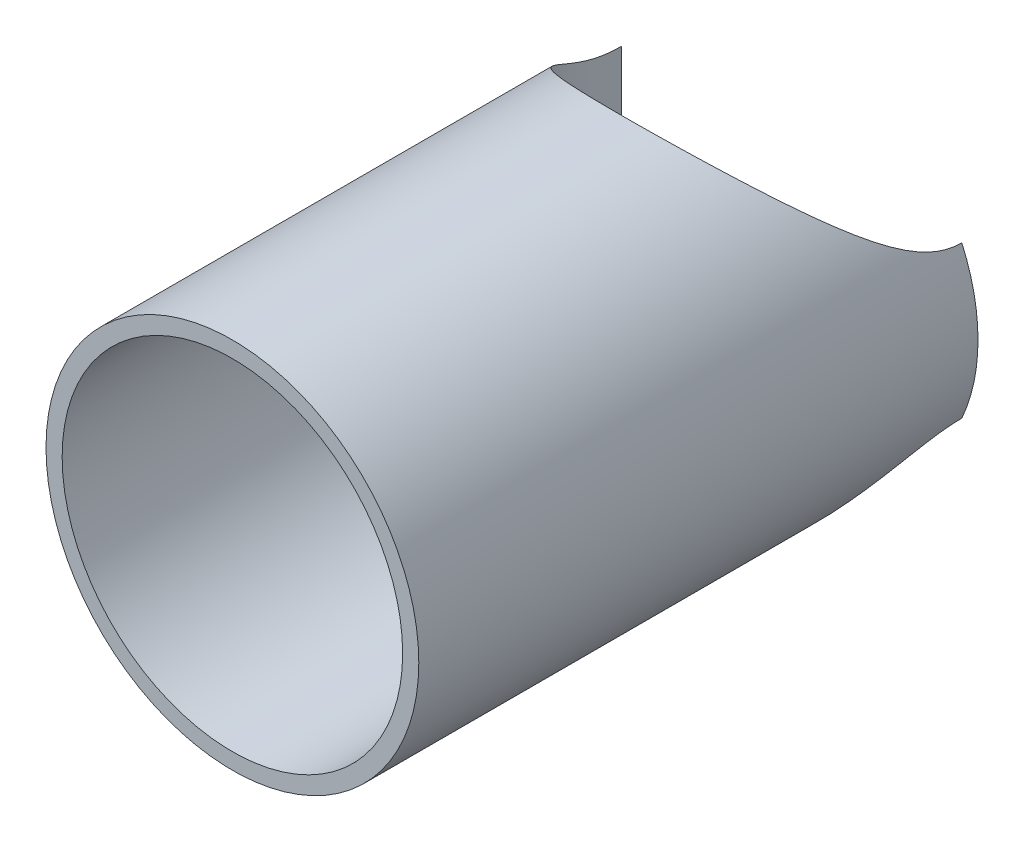
ISO-10303-21;
HEADER;
FILE_DESCRIPTION(('STEP AP214'),'2;1');
FILE_NAME('part.step','',(''),(''),'','','');
FILE_SCHEMA(('AUTOMOTIVE_DESIGN { 1 0 10303 214 1 1 1 1 }'));
ENDSEC;
DATA;
#1=APPLICATION_CONTEXT('core data for automotive mechanical design processes');
#2=APPLICATION_PROTOCOL_DEFINITION('international standard','automotive_design',2000,#1);
#3=PRODUCT_CONTEXT('',#1,'mechanical');
#4=PRODUCT('Part','Part','',(#3));
#5=PRODUCT_RELATED_PRODUCT_CATEGORY('part','',(#4));
#6=PRODUCT_DEFINITION_FORMATION('','',#4);
#7=PRODUCT_DEFINITION_CONTEXT('part definition',#1,'design');
#8=PRODUCT_DEFINITION('design','',#6,#7);
#9=PRODUCT_DEFINITION_SHAPE('','',#8);
#10=(LENGTH_UNIT() NAMED_UNIT(*) SI_UNIT(.MILLI.,.METRE.));
#11=(NAMED_UNIT(*) PLANE_ANGLE_UNIT() SI_UNIT($,.RADIAN.));
#12=(NAMED_UNIT(*) SI_UNIT($,.STERADIAN.) SOLID_ANGLE_UNIT());
#13=UNCERTAINTY_MEASURE_WITH_UNIT(LENGTH_MEASURE(1.E-05),#10,'distance_accuracy_value','');
#14=(GEOMETRIC_REPRESENTATION_CONTEXT(3) GLOBAL_UNCERTAINTY_ASSIGNED_CONTEXT((#13)) GLOBAL_UNIT_ASSIGNED_CONTEXT((#10,
#11,#12)) REPRESENTATION_CONTEXT('',''));
#15=CARTESIAN_POINT('',(0.,0.,0.));
#16=DIRECTION('',(0.,0.,1.));
#17=DIRECTION('',(1.,0.,0.));
#18=AXIS2_PLACEMENT_3D('',#15,#16,#17);
#19=CARTESIAN_POINT('',(0.,0.,0.));
#20=DIRECTION('',(0.,0.,1.));
#21=DIRECTION('',(1.,0.,0.));
#22=AXIS2_PLACEMENT_3D('',#19,#20,#21);
#23=CYLINDRICAL_SURFACE('',#22,17.399);
#24=CARTESIAN_POINT('',(0.,0.,57.15));
#25=DIRECTION('',(0.,0.,1.));
#26=DIRECTION('',(1.,0.,0.));
#27=AXIS2_PLACEMENT_3D('',#24,#25,#26);
#28=CIRCLE('',#27,17.399);
#29=CARTESIAN_POINT('',(17.399,0.,57.15));
#30=VERTEX_POINT('',#29);
#31=EDGE_CURVE('E63',#30,#30,#28,.T.);
#32=ORIENTED_EDGE('',*,*,#31,.T.);
#33=EDGE_LOOP('',(#32));
#34=FACE_BOUND('',#33,.T.);
#35=CARTESIAN_POINT('',(0.,0.,0.));
#36=DIRECTION('',(0.,0.707106781186547,0.707106781186547));
#37=DIRECTION('',(0.,-0.707106781186547,0.707106781186547));
#38=AXIS2_PLACEMENT_3D('',#35,#36,#37);
#39=ELLIPSE('',#38,24.6059017717295,17.399);
#40=CARTESIAN_POINT('',(17.399,0.,0.));
#41=VERTEX_POINT('',#40);
#42=CARTESIAN_POINT('',(-17.399,0.,0.));
#43=VERTEX_POINT('',#42);
#44=EDGE_CURVE('E66',#41,#43,#39,.F.);
#45=ORIENTED_EDGE('',*,*,#44,.T.);
#46=CARTESIAN_POINT('',(-17.399,0.,0.));
#47=CARTESIAN_POINT('',(-17.3990011308637,0.331328994913658,0.331288499369272));
#48=CARTESIAN_POINT('',(-17.3895359806133,0.662777773993524,0.662452537391861));
#49=CARTESIAN_POINT('',(-17.3541828902262,1.28061881246956,1.27984220901783));
#50=CARTESIAN_POINT('',(-17.3306707170862,1.56708522254114,1.56613126731348));
#51=CARTESIAN_POINT('',(-17.2741593932983,2.09467960281504,2.09380128423432));
#52=CARTESIAN_POINT('',(-17.2431973119173,2.33594824844743,2.33526043823023));
#53=CARTESIAN_POINT('',(-17.1776790099059,2.77346193365283,2.77318291899473));
#54=CARTESIAN_POINT('',(-17.1448260231368,2.96984141024758,2.96976916303656));
#55=CARTESIAN_POINT('',(-17.053195396441,3.46498957987095,3.46509972389225));
#56=CARTESIAN_POINT('',(-16.98985851291,3.76343285860517,3.76334049026127));
#57=CARTESIAN_POINT('',(-16.8511806994521,4.34120611378342,4.34086899698307));
#58=CARTESIAN_POINT('',(-16.7767389829828,4.62064871339775,4.62026081720835));
#59=CARTESIAN_POINT('',(-16.618357658026,5.16038592403,5.16002415026488));
#60=CARTESIAN_POINT('',(-16.5352733410015,5.42080962241243,5.42051715790507));
#61=CARTESIAN_POINT('',(-16.3619682824427,5.9225854699662,5.92246621840775));
#62=CARTESIAN_POINT('',(-16.2725596410971,6.16407928160144,6.16406139907093));
#63=CARTESIAN_POINT('',(-16.0648641936773,6.68870400423923,6.68872514664784));
#64=CARTESIAN_POINT('',(-15.9442842191765,6.97140000285117,6.97132558864669));
#65=CARTESIAN_POINT('',(-15.692090264551,7.52138357655295,7.52117234296158));
#66=CARTESIAN_POINT('',(-15.5611400425067,7.7888244237628,7.78856984279287));
#67=CARTESIAN_POINT('',(-15.2898825899193,8.30823658158246,8.30799045094507));
#68=CARTESIAN_POINT('',(-15.1502208515848,8.56037821331848,8.56017986480889));
#69=CARTESIAN_POINT('',(-14.8631475667476,9.04924098266211,9.04916207079481));
#70=CARTESIAN_POINT('',(-14.716363574788,9.28614688008941,9.28613845727461));
#71=CARTESIAN_POINT('',(-14.3951906833458,9.77740171343267,9.77741091638758));
#72=CARTESIAN_POINT('',(-14.2195041976432,10.0313338750929,10.0312781848761));
#73=CARTESIAN_POINT('',(-13.8583245878214,10.524357664459,10.5242054716175));
#74=CARTESIAN_POINT('',(-13.6733966582859,10.7636567269108,10.7634718304358));
#75=CARTESIAN_POINT('',(-13.2950314709039,11.2273598541476,11.2271796122021));
#76=CARTESIAN_POINT('',(-13.1021449124595,11.4519894946947,11.4518441165275));
#77=CARTESIAN_POINT('',(-12.7091177143155,11.8863833716026,11.8863260772742));
#78=CARTESIAN_POINT('',(-12.5095124093792,12.0963898718007,12.0963850678313));
#79=CARTESIAN_POINT('',(-12.0888476825434,12.5170535611354,12.5170585405004));
#80=CARTESIAN_POINT('',(-11.867271036784,12.7274545640097,12.7274132906681));
#81=CARTESIAN_POINT('',(-11.4161369932612,13.1334001596869,13.1332890696922));
#82=CARTESIAN_POINT('',(-11.1870452916996,13.3292035388693,13.3290682211509));
#83=CARTESIAN_POINT('',(-10.7219396261346,13.7059083660326,13.7057759704559));
#84=CARTESIAN_POINT('',(-10.4863707163118,13.8870849012415,13.8869780619076));
#85=CARTESIAN_POINT('',(-10.0093409437893,14.2345561896179,14.2345143840518));
#86=CARTESIAN_POINT('',(-9.76830223262916,14.4011404127409,14.4011376187175));
#87=CARTESIAN_POINT('',(-9.27469282491392,14.7238513521684,14.7238541327518));
#88=CARTESIAN_POINT('',(-9.02218317762893,14.8800245173527,14.8799942085943));
#89=CARTESIAN_POINT('',(-8.51143320550011,15.17780577695,15.1777255632559));
#90=CARTESIAN_POINT('',(-8.25351231100356,15.3196868999698,15.3195894701364));
#91=CARTESIAN_POINT('',(-7.86055793692457,15.522822723787,15.5227259132659));
#92=CARTESIAN_POINT('',(-7.72987393547371,15.5883224924115,15.5882301268393));
#93=CARTESIAN_POINT('',(-7.46744079934224,15.7157097134347,15.7156329083403));
#94=CARTESIAN_POINT('',(-7.33572578439618,15.7776322605029,15.7775664862578));
#95=CARTESIAN_POINT('',(-7.0713408526649,15.89786675948,15.8978253102093));
#96=CARTESIAN_POINT('',(-6.93870294731716,15.9562139212813,15.9561857364243));
#97=CARTESIAN_POINT('',(-6.67257484172981,16.0693059665347,16.0692983003262));
#98=CARTESIAN_POINT('',(-6.5391145696896,16.124086000282,16.1240856593634));
#99=CARTESIAN_POINT('',(-6.27314212663758,16.2293820508048,16.2293823833748));
#100=CARTESIAN_POINT('',(-6.14068677200883,16.2799696359967,16.2799636546496));
#101=CARTESIAN_POINT('',(-5.8748684496391,16.3777589819801,16.3777371159858));
#102=CARTESIAN_POINT('',(-5.74152553126073,16.4249879659121,16.4249565601746));
#103=CARTESIAN_POINT('',(-5.47402115877983,16.5160550971116,16.5160062636609));
#104=CARTESIAN_POINT('',(-5.33987788890363,16.5599199494832,16.5598632139616));
#105=CARTESIAN_POINT('',(-5.0708615482511,16.6442561413558,16.6441886913204));
#106=CARTESIAN_POINT('',(-4.93600480608221,16.6847535344294,16.6846832285512));
#107=CARTESIAN_POINT('',(-4.66564969995905,16.7623545036231,16.762284561608));
#108=CARTESIAN_POINT('',(-4.53016583341798,16.7994833464645,16.7994165741733));
#109=CARTESIAN_POINT('',(-4.25864402464156,16.8703492415508,16.8702936771996));
#110=CARTESIAN_POINT('',(-4.1226187875179,16.9041106384636,16.9040630739031));
#111=CARTESIAN_POINT('',(-3.85010126264908,16.9682459387044,16.9682159832133));
#112=CARTESIAN_POINT('',(-3.7136199403314,16.9986431310521,16.9986227724491));
#113=CARTESIAN_POINT('',(-3.44027598403682,17.0560566629996,17.0560512035975));
#114=CARTESIAN_POINT('',(-3.30342264906392,17.0830951044979,17.0830949768953));
#115=CARTESIAN_POINT('',(-3.03546364409865,17.1326815825355,17.132681703699));
#116=CARTESIAN_POINT('',(-2.90441642762355,17.1553873643714,17.1553829144864));
#117=CARTESIAN_POINT('',(-2.64192370290757,17.1977626436417,17.1977466393632));
#118=CARTESIAN_POINT('',(-2.51048219796085,17.2174445285761,17.2174215511955));
#119=CARTESIAN_POINT('',(-2.24727207444598,17.2537692378582,17.2537335254227));
#120=CARTESIAN_POINT('',(-2.11550651579715,17.2704231484942,17.2703816696755));
#121=CARTESIAN_POINT('',(-1.85171901959868,17.3006908882117,17.3006415630633));
#122=CARTESIAN_POINT('',(-1.71969931056298,17.3143144308917,17.3142630138654));
#123=CARTESIAN_POINT('',(-1.45547409463277,17.3385220761164,17.3384708920411));
#124=CARTESIAN_POINT('',(-1.323270104293,17.3491144575098,17.3490655860987));
#125=CARTESIAN_POINT('',(-1.05874661674972,17.3672620877226,17.36722140925));
#126=CARTESIAN_POINT('',(-0.926428051590948,17.3748241285407,17.3747893222893));
#127=CARTESIAN_POINT('',(-0.661745401360201,17.3869150272733,17.3868930938386));
#128=CARTESIAN_POINT('',(-0.529381797623768,17.3914491490759,17.3914342142522));
#129=CARTESIAN_POINT('',(-0.264678682179303,17.3974897824417,17.3974858865217));
#130=CARTESIAN_POINT('',(-0.13233933998178,17.3989999999915,17.3990001479815));
#131=CARTESIAN_POINT('',(0.132343102844987,17.3990000000085,17.3989998520142));
#132=CARTESIAN_POINT('',(0.264686203474104,17.3974896965932,17.3974852084662));
#133=CARTESIAN_POINT('',(0.529395756251864,17.3914487446318,17.3914329206721));
#134=CARTESIAN_POINT('',(0.661762040001853,17.3869144144388,17.3868915915467));
#135=CARTESIAN_POINT('',(0.92644896772938,17.3748230255675,17.3747874520819));
#136=CARTESIAN_POINT('',(1.0587691326032,17.3672607273787,17.3672194044208));
#137=CARTESIAN_POINT('',(1.32329473756529,17.3491125827395,17.3490633877189));
#138=CARTESIAN_POINT('',(1.4554992489517,17.3385199686424,17.3384686592246));
#139=CARTESIAN_POINT('',(1.71972442920772,17.3143119319016,17.3142607827641));
#140=CARTESIAN_POINT('',(1.85174358595603,17.3006882546736,17.300639392332));
#141=CARTESIAN_POINT('',(2.11552890590344,17.2704203934741,17.270379685527));
#142=CARTESIAN_POINT('',(2.24729284607558,17.2537665200233,17.2537316913085));
#143=CARTESIAN_POINT('',(2.51049867631982,17.2174421050912,17.2174201090593));
#144=CARTESIAN_POINT('',(2.64193751299076,17.1977605012373,17.1977454625961));
#145=CARTESIAN_POINT('',(2.90442384157753,17.1553860801165,17.1553822628499));
#146=CARTESIAN_POINT('',(3.03546733761075,17.1326808990283,17.1326813342488));
#147=CARTESIAN_POINT('',(3.30342657291425,17.0830943783941,17.0830939200179));
#148=CARTESIAN_POINT('',(3.44028379405071,17.0560551202761,17.0560490037316));
#149=CARTESIAN_POINT('',(3.71363437804045,16.9986400001387,16.9986186527062));
#150=CARTESIAN_POINT('',(3.85011845296442,16.9682420615591,16.9682111142236));
#151=CARTESIAN_POINT('',(4.12264033144995,16.904105398461,16.9040569697761));
#152=CARTESIAN_POINT('',(4.25866718163659,16.870343410098,16.8702871133423));
#153=CARTESIAN_POINT('',(4.53019108564152,16.7994765416222,16.7994093825609));
#154=CARTESIAN_POINT('',(4.66567544748057,16.76234734177,16.7622772275004));
#155=CARTESIAN_POINT('',(4.9360304323311,16.6847459483422,16.6846758961775));
#156=CARTESIAN_POINT('',(5.0708865720189,16.6442485126905,16.6441815277317));
#157=CARTESIAN_POINT('',(5.33990061783175,16.55991260583,16.5598566711235));
#158=CARTESIAN_POINT('',(5.47404221030653,16.5160481053818,16.5160001963081));
#159=CARTESIAN_POINT('',(5.74154217437029,16.4249821235549,16.4249517522341));
#160=CARTESIAN_POINT('',(5.87488237757024,16.3777539610281,16.377733114662));
#161=CARTESIAN_POINT('',(6.14069421589947,16.2799667936959,16.2799614823963));
#162=CARTESIAN_POINT('',(6.27314581793012,16.2293805894571,16.2293812542933));
#163=CARTESIAN_POINT('',(6.53911843369672,16.1240844705558,16.1240837889914));
#164=CARTESIAN_POINT('',(6.6725825007365,16.0693028234905,16.0692944809927));
#165=CARTESIAN_POINT('',(6.93871704145251,15.9562078188688,15.956178611685));
#166=CARTESIAN_POINT('',(7.07135760783225,15.8978593336773,15.8978168557831));
#167=CARTESIAN_POINT('',(7.33574670377706,15.7776225505781,15.7775558713312));
#168=CARTESIAN_POINT('',(7.46746324313444,15.7156990653493,15.7156214868573));
#169=CARTESIAN_POINT('',(7.72989830986156,15.5883104113434,15.5882176122188));
#170=CARTESIAN_POINT('',(7.86058273950878,15.5228101701612,15.5227131352272));
#171=CARTESIAN_POINT('',(8.25353521535424,15.3196745134129,15.3195775255319));
#172=CARTESIAN_POINT('',(8.51145389332373,15.177794126177,15.1777148432391));
#173=CARTESIAN_POINT('',(9.02219526517278,14.8800170481196,14.8799876943916));
#174=CARTESIAN_POINT('',(9.27469871505861,14.7238475016823,14.7238507467716));
#175=CARTESIAN_POINT('',(9.76830834571355,14.4011364157789,14.4011331548459));
#176=CARTESIAN_POINT('',(10.0093528614838,14.2345479589407,14.2345052423058));
#177=CARTESIAN_POINT('',(10.4863899241457,13.8870704451552,13.8869626730327));
#178=CARTESIAN_POINT('',(10.7219605410667,13.7058920566566,13.7057591792237));
#179=CARTESIAN_POINT('',(11.1870656131564,13.3291864289314,13.3290515004162));
#180=CARTESIAN_POINT('',(11.4161552377849,13.1333842417648,13.1332739587925));
#181=CARTESIAN_POINT('',(11.8672815432061,12.7274445947568,12.7274041499341));
#182=CARTESIAN_POINT('',(12.088852755031,12.5170484889207,12.517053873492));
#183=CARTESIAN_POINT('',(12.5095175578729,12.0963847230684,12.0963795279133));
#184=CARTESIAN_POINT('',(12.7091276713605,11.8863729021756,11.8863148376935));
#185=CARTESIAN_POINT('',(13.1021607290177,11.4519714571547,11.4518252711373));
#186=CARTESIAN_POINT('',(13.2950485751887,11.2273396628897,11.2271589823143));
#187=CARTESIAN_POINT('',(13.6734130173025,10.7636358783721,10.763451251504));
#188=CARTESIAN_POINT('',(13.858339153512,10.524338411798,10.5241868247927));
#189=CARTESIAN_POINT('',(14.2195124215554,10.031321996054,10.0312669453136));
#190=CARTESIAN_POINT('',(14.3951946051437,9.7773957150844,9.77740523066256));
#191=CARTESIAN_POINT('',(14.7163674472392,9.28614095665167,9.28613224729147));
#192=CARTESIAN_POINT('',(14.8631549792588,9.04922902525791,9.04914954618527));
#193=CARTESIAN_POINT('',(15.1502323847489,8.56035787657117,8.56015891678717));
#194=CARTESIAN_POINT('',(15.2898949291603,8.30821395404564,8.3079674730765));
#195=CARTESIAN_POINT('',(15.5611515555253,7.78880133314123,7.78854689744975));
#196=CARTESIAN_POINT('',(15.6921003797321,7.52136237689545,7.52115152000875));
#197=CARTESIAN_POINT('',(15.944289741381,6.97138706353182,6.97131306349413));
#198=CARTESIAN_POINT('',(16.0648667682493,6.68869750139016,6.68871884448677));
#199=CARTESIAN_POINT('',(16.2725620824778,6.16407311454511,6.16405506139386));
#200=CARTESIAN_POINT('',(16.3619728725739,5.92257307722494,5.92245348547243));
#201=CARTESIAN_POINT('',(16.535280221155,5.42078874277266,5.42049589512133));
#202=CARTESIAN_POINT('',(16.618364872423,5.16036280687721,5.16000079710574));
#203=CARTESIAN_POINT('',(16.7767453827511,4.62062534005807,4.62023748154183));
#204=CARTESIAN_POINT('',(16.8511861632785,4.34118475559803,4.34084779902526));
#205=CARTESIAN_POINT('',(16.9898612578486,3.76341993156685,3.7633277559053));
#206=CARTESIAN_POINT('',(17.053196594646,3.464983105639,3.46509333680204));
#207=CARTESIAN_POINT('',(17.1448268330524,2.96983703330779,2.96976472575839));
#208=CARTESIAN_POINT('',(17.1776804769336,2.77345316738225,2.7731740281345));
#209=CARTESIAN_POINT('',(17.2431993186325,2.33593358655074,2.33524560548374));
#210=CARTESIAN_POINT('',(17.2741613748475,2.09466343246891,2.09378498081143));
#211=CARTESIAN_POINT('',(17.3306721606797,1.567068988297,1.56611497024853));
#212=CARTESIAN_POINT('',(17.3541839563502,1.28060403473809,1.27982739369487));
#213=CARTESIAN_POINT('',(17.3895362343148,0.66276888754068,0.662443645442081));
#214=CARTESIAN_POINT('',(17.3990011304629,0.331324551349306,0.331284053321532));
#215=CARTESIAN_POINT('',(17.399,0.,0.));
#216=B_SPLINE_CURVE_WITH_KNOTS('',3,(#46,#47,#48,#49,#50,#51,#52,#53,#54,#55,#56,#57,#58,#59,
#60,#61,#62,#63,#64,#65,#66,#67,#68,#69,#70,#71,#72,#73,#74,#75,#76,#77,#78,#79,#80,#81,#82,#83,
#84,#85,#86,#87,#88,#89,#90,#91,#92,#93,#94,#95,#96,#97,#98,#99,#100,#101,#102,#103,#104,#105,
#106,#107,#108,#109,#110,#111,#112,#113,#114,#115,#116,#117,#118,#119,#120,#121,#122,#123,#124,
#125,#126,#127,#128,#129,#130,#131,#132,#133,#134,#135,#136,#137,#138,#139,#140,#141,#142,#143,
#144,#145,#146,#147,#148,#149,#150,#151,#152,#153,#154,#155,#156,#157,#158,#159,#160,#161,#162,
#163,#164,#165,#166,#167,#168,#169,#170,#171,#172,#173,#174,#175,#176,#177,#178,#179,#180,#181,
#182,#183,#184,#185,#186,#187,#188,#189,#190,#191,#192,#193,#194,#195,#196,#197,#198,#199,#200,
#201,#202,#203,#204,#205,#206,#207,#208,#209,#210,#211,#212,#213,#214,#215),.UNSPECIFIED.,.F.,
.F.,(4,2,2,2,2,2,2,2,2,2,2,2,2,2,2,2,2,2,2,2,2,2,2,2,2,2,2,2,2,2,2,2,2,2,2,2,2,2,2,2,2,2,2,2,2,
2,2,2,2,2,2,2,2,2,2,2,2,2,2,2,2,2,2,2,2,2,2,2,2,2,2,2,2,2,2,2,2,2,2,2,2,2,2,2,4),(0.,
1.40551630396895,2.62231117885233,3.65037899448081,4.48971758438184,5.76932583809445,
6.9753849332022,8.10794438794428,9.16706431128378,10.4192554462773,11.6195891287589,
12.7682494574323,13.8654466039762,15.0642686263511,16.2207668838282,17.3353827550133,
18.4086093128293,19.521019988392,20.5986721998633,21.6423941807822,22.6530975875911,
23.6589392392227,24.6386430781611,25.1191397415278,25.5935874776259,26.0621612660575,
26.5250427479471,26.9765889886385,27.423915460162,27.867213682969,28.3066804441005,
28.7425177205185,29.1749325751135,29.6041370240872,30.0303478746664,30.4350509025217,
30.8380491089705,31.239540728672,31.6397262351866,32.0388080704063,32.4369903595961,
32.8344786138765,33.23147942219,33.6284915186038,34.0259878478789,34.42417498677,
34.8232584392862,35.2234423286034,35.6249290994545,36.0279192330441,36.4326109763195,
36.8588341719642,37.2880474518629,37.720467610057,38.1563066551372,38.5957716476569,
39.0390645671939,39.486382208024,39.9379161021075,40.4008112215822,40.8693947623903,
41.3438483542563,41.8243469702461,42.8040430011724,43.8098612581141,44.8205903103499,
45.8643208478344,46.9419645023942,48.0543495253715,49.1276035107911,50.2422285290847,
51.3987176391151,52.5975122283296,53.6947376105801,54.8434073531731,56.043731621553,
57.2958945179331,58.3550419584849,59.487610586171,60.6936605083512,61.9732412444898,
62.8125986887249,63.8406727889923,65.0574613794757,66.4629588311663),.UNSPECIFIED.);
#217=EDGE_CURVE('E55',#43,#41,#216,.T.);
#218=ORIENTED_EDGE('',*,*,#217,.T.);
#219=EDGE_LOOP('',(#45,#218));
#220=FACE_BOUND('',#219,.T.);
#221=ADVANCED_FACE('F16',(#34,#220),#23,.F.);
#222=CARTESIAN_POINT('',(0.,0.,57.15));
#223=DIRECTION('',(0.,0.,-1.));
#224=DIRECTION('',(-1.,0.,0.));
#225=AXIS2_PLACEMENT_3D('',#222,#223,#224);
#226=PLANE('',#225);
#227=ORIENTED_EDGE('',*,*,#31,.F.);
#228=EDGE_LOOP('',(#227));
#229=FACE_BOUND('',#228,.T.);
#230=CARTESIAN_POINT('',(0.,0.,57.15));
#231=DIRECTION('',(0.,0.,1.));
#232=DIRECTION('',(1.,0.,0.));
#233=AXIS2_PLACEMENT_3D('',#230,#231,#232);
#234=CIRCLE('',#233,19.05);
#235=CARTESIAN_POINT('',(19.05,0.,57.15));
#236=VERTEX_POINT('',#235);
#237=EDGE_CURVE('E86',#236,#236,#234,.F.);
#238=ORIENTED_EDGE('',*,*,#237,.F.);
#239=EDGE_LOOP('',(#238));
#240=FACE_BOUND('',#239,.T.);
#241=ADVANCED_FACE('F121',(#229,#240),#226,.F.);
#242=CARTESIAN_POINT('',(0.,0.,0.));
#243=DIRECTION('',(0.,1.,0.));
#244=DIRECTION('',(0.,0.,1.));
#245=AXIS2_PLACEMENT_3D('',#242,#243,#244);
#246=CYLINDRICAL_SURFACE('',#245,17.399);
#247=ORIENTED_EDGE('',*,*,#217,.F.);
#248=DIRECTION('',(0.,1.,0.));
#249=VECTOR('',#248,1.);
#250=CARTESIAN_POINT('',(-17.399,0.,0.));
#251=LINE('',#250,#249);
#252=CARTESIAN_POINT('',(-17.399,7.75740285147033,0.));
#253=VERTEX_POINT('',#252);
#254=EDGE_CURVE('E60',#253,#43,#251,.F.);
#255=ORIENTED_EDGE('',*,*,#254,.F.);
#256=CARTESIAN_POINT('',(17.399,7.75740285147032,0.));
#257=CARTESIAN_POINT('',(17.3990027926557,7.75738928067626,0.126619411653411));
#258=CARTESIAN_POINT('',(17.3976172953479,7.76050481767002,0.25321342214225));
#259=CARTESIAN_POINT('',(17.3920993093259,7.7728663106787,0.506011561056936));
#260=CARTESIAN_POINT('',(17.3879674951789,7.78211076127069,0.632215777580589));
#261=CARTESIAN_POINT('',(17.3715310393773,7.81876986710136,1.00902330778525));
#262=CARTESIAN_POINT('',(17.3551849725285,7.85511193712096,1.25863541656879));
#263=CARTESIAN_POINT('',(17.3126787054344,7.94834436267528,1.74803233786395));
#264=CARTESIAN_POINT('',(17.2867118539878,8.00482912325347,1.98791378893045));
#265=CARTESIAN_POINT('',(17.2256220476168,8.13545614886296,2.46176178605719));
#266=CARTESIAN_POINT('',(17.1904915826852,8.20961289257842,2.69572330712606));
#267=CARTESIAN_POINT('',(17.0914704002142,8.41444164911149,3.27608545997221));
#268=CARTESIAN_POINT('',(17.0220928683165,8.55453145327276,3.6182148201961));
#269=CARTESIAN_POINT('',(16.8659507450822,8.85840913920196,4.2875618159471));
#270=CARTESIAN_POINT('',(16.7791763237468,9.02221040436538,4.6147708919803));
#271=CARTESIAN_POINT('',(16.5885907607409,9.36806215757178,5.25908025866418));
#272=CARTESIAN_POINT('',(16.4846028375362,9.55029344833314,5.57602990071133));
#273=CARTESIAN_POINT('',(16.2611162606568,9.92604811707565,6.19761374754541));
#274=CARTESIAN_POINT('',(16.1416117153161,10.1195757688457,6.50224321644266));
#275=CARTESIAN_POINT('',(15.9012328343761,10.4927199440383,7.0682446326165));
#276=CARTESIAN_POINT('',(15.7818795075659,10.6716028930283,7.33075234639334));
#277=CARTESIAN_POINT('',(15.531375280231,11.0330066315397,7.84755054304734));
#278=CARTESIAN_POINT('',(15.4002228366692,11.2155278944272,8.10183994524194));
#279=CARTESIAN_POINT('',(15.1261173325553,11.5825543909568,8.60275103720113));
#280=CARTESIAN_POINT('',(14.9831580377589,11.7670606274058,8.84936858024162));
#281=CARTESIAN_POINT('',(14.6854749405307,12.1365419716062,9.33504840785215));
#282=CARTESIAN_POINT('',(14.5307500246226,12.3215171221294,9.57410997430043));
#283=CARTESIAN_POINT('',(14.0499414824725,12.873976753931,10.2784757466186));
#284=CARTESIAN_POINT('',(13.706221982577,13.2403569500405,10.7327911450247));
#285=CARTESIAN_POINT('',(12.9709988366539,13.9614056628348,11.6105902831832));
#286=CARTESIAN_POINT('',(12.5795204493307,14.3160802453506,12.0340901330639));
#287=CARTESIAN_POINT('',(11.8513027830295,14.9202493412787,12.7460780346227));
#288=CARTESIAN_POINT('',(11.5252152004648,15.17393857843,13.0419213680792));
#289=CARTESIAN_POINT('',(10.8451357651757,15.6672254345686,13.6126880208168));
#290=CARTESIAN_POINT('',(10.4911442114866,15.9068232045201,13.8876115642246));
#291=CARTESIAN_POINT('',(9.75564643242529,16.3682053590736,14.4137713143204));
#292=CARTESIAN_POINT('',(9.37416774185506,16.5900071123435,14.6650306596365));
#293=CARTESIAN_POINT('',(8.58390774378863,17.0123369264844,15.1411487148883));
#294=CARTESIAN_POINT('',(8.17513251731962,17.2128696999897,15.3660132743823));
#295=CARTESIAN_POINT('',(7.41609675759785,17.5510787980119,15.7438449488538));
#296=CARTESIAN_POINT('',(7.07052907343836,17.6932976749746,15.9021892450144));
#297=CARTESIAN_POINT('',(6.36382451687043,17.9595864108884,16.1979501260028));
#298=CARTESIAN_POINT('',(6.00269106933712,18.0836602360993,16.3353712846128));
#299=CARTESIAN_POINT('',(5.26647789377182,18.3116118596446,16.5873660705376));
#300=CARTESIAN_POINT('',(4.89140366751785,18.4154975265765,16.7019485999545));
#301=CARTESIAN_POINT('',(4.12923028647434,18.6012306252741,16.9065171053999));
#302=CARTESIAN_POINT('',(3.74213100127713,18.6830778179467,16.9965028145804));
#303=CARTESIAN_POINT('',(2.95593537190506,18.8235337773239,17.1507769807365));
#304=CARTESIAN_POINT('',(2.55677683000922,18.8819860313285,17.2148923872178));
#305=CARTESIAN_POINT('',(1.75207798329656,18.9735785556383,17.3153056168189));
#306=CARTESIAN_POINT('',(1.34653766138734,19.0067187581382,17.3516033654214));
#307=CARTESIAN_POINT('',(0.532740871466215,19.0469054092445,17.3956140232931));
#308=CARTESIAN_POINT('',(0.124485289769621,19.0539599906146,17.4033358417348));
#309=CARTESIAN_POINT('',(-0.691145635542919,19.0418258138202,17.3900500247943));
#310=CARTESIAN_POINT('',(-1.09852104488593,19.02263908821,17.3690446145166));
#311=CARTESIAN_POINT('',(-1.8665074066449,18.9618364386318,17.3024305274246));
#312=CARTESIAN_POINT('',(-2.22756908470296,18.9227652631555,17.2596128163397));
#313=CARTESIAN_POINT('',(-2.94361664813323,18.8246695916722,17.1520079260685));
#314=CARTESIAN_POINT('',(-3.29860304440391,18.7656467822389,17.0872226038712));
#315=CARTESIAN_POINT('',(-4.0003834177903,18.6286682489913,16.9366748894927));
#316=CARTESIAN_POINT('',(-4.34717668373009,18.5507108882069,16.8509106835957));
#317=CARTESIAN_POINT('',(-5.03073264287061,18.3771216594109,16.65961931318));
#318=CARTESIAN_POINT('',(-5.36749474073485,18.2814887447958,16.5540909783843));
#319=CARTESIAN_POINT('',(-6.0450883689476,18.0690712727941,16.319211609248));
#320=CARTESIAN_POINT('',(-6.38536566225004,17.9515031398445,16.1889732182396));
#321=CARTESIAN_POINT('',(-7.05200979717746,17.7002421296737,15.9099012910429));
#322=CARTESIAN_POINT('',(-7.37837661185776,17.5665492212207,15.7610677188377));
#323=CARTESIAN_POINT('',(-8.01637955747606,17.2847274052077,15.4463398391999));
#324=CARTESIAN_POINT('',(-8.328012631591,17.1365955213283,15.2804420139058));
#325=CARTESIAN_POINT('',(-8.935938653738,16.8275912941987,14.9330779736276));
#326=CARTESIAN_POINT('',(-9.23222831724048,16.6667162415391,14.751608447154));
#327=CARTESIAN_POINT('',(-9.9610807011477,16.24616265681,14.2751141336036));
#328=CARTESIAN_POINT('',(-10.3832304302347,15.9790705087056,13.9706188807904));
#329=CARTESIAN_POINT('',(-11.1906483352997,15.4243967388524,13.3326512383542));
#330=CARTESIAN_POINT('',(-11.5758996118658,15.1368058328948,12.9991657033674));
#331=CARTESIAN_POINT('',(-12.3107246973626,14.5454983316236,12.3055766392129));
#332=CARTESIAN_POINT('',(-12.6601983724747,14.2417399093146,11.9454030182208));
#333=CARTESIAN_POINT('',(-13.3228256699069,13.6238744147983,11.2015895641249));
#334=CARTESIAN_POINT('',(-13.6359864105728,13.3097693863682,10.8179543527437));
#335=CARTESIAN_POINT('',(-14.2338486111263,12.6687294700676,10.0188698517803));
#336=CARTESIAN_POINT('',(-14.517686463156,12.3416676006416,9.60287793519721));
#337=CARTESIAN_POINT('',(-15.0487827113267,11.688186754623,8.74718214020965));
#338=CARTESIAN_POINT('',(-15.2960234328361,11.3617681633013,8.30746694358541));
#339=CARTESIAN_POINT('',(-15.6391176739874,10.8793160856903,7.62936065904868));
#340=CARTESIAN_POINT('',(-15.7488029782036,10.719778727444,7.40036468575159));
#341=CARTESIAN_POINT('',(-15.9589029321097,10.4044108647402,6.93568044188579));
#342=CARTESIAN_POINT('',(-16.0593187405627,10.2485798987662,6.69999301263361));
#343=CARTESIAN_POINT('',(-16.25064002581,9.94242216980458,6.22159236078593));
#344=CARTESIAN_POINT('',(-16.3415534376162,9.79209088359618,5.9788852198135));
#345=CARTESIAN_POINT('',(-16.5136633013956,9.49896230357114,5.48564865833395));
#346=CARTESIAN_POINT('',(-16.5948621460068,9.35616315949889,5.23512118317326));
#347=CARTESIAN_POINT('',(-16.7399044598348,9.0938654480011,4.74960595279279));
#348=CARTESIAN_POINT('',(-16.8046633839798,8.97344114073015,4.51539494834857));
#349=CARTESIAN_POINT('',(-16.9253972886873,8.74358476749362,4.03935876063696));
#350=CARTESIAN_POINT('',(-16.981371807116,8.63415327995198,3.79753317758154));
#351=CARTESIAN_POINT('',(-17.0835577011958,8.43015385639926,3.30749209621929));
#352=CARTESIAN_POINT('',(-17.1298288043977,8.33549596631582,3.05932691299979));
#353=CARTESIAN_POINT('',(-17.2122316312634,8.16398538994439,2.5552691644349));
#354=CARTESIAN_POINT('',(-17.2483680118588,8.08712452871587,2.29938020825192));
#355=CARTESIAN_POINT('',(-17.2984619179858,7.97921413520514,1.87510757973661));
#356=CARTESIAN_POINT('',(-17.3157056836072,7.94167042397934,1.70875077851932));
#357=CARTESIAN_POINT('',(-17.3454986249528,7.87638621901043,1.37373521286451));
#358=CARTESIAN_POINT('',(-17.35804919276,7.84864281846194,1.20507714643116));
#359=CARTESIAN_POINT('',(-17.3783689967595,7.80355358549084,0.864236195915917));
#360=CARTESIAN_POINT('',(-17.386085725966,7.78632198711612,0.692034904492624));
#361=CARTESIAN_POINT('',(-17.3964114605965,7.76320820627028,0.346566926126348));
#362=CARTESIAN_POINT('',(-17.3990157927525,7.75733640792047,0.173299409508219));
#363=CARTESIAN_POINT('',(-17.399,7.75740285147036,0.));
#364=B_SPLINE_CURVE_WITH_KNOTS('',3,(#256,#257,#258,#259,#260,#261,#262,#263,#264,#265,#266,
#267,#268,#269,#270,#271,#272,#273,#274,#275,#276,#277,#278,#279,#280,#281,#282,#283,#284,#285,
#286,#287,#288,#289,#290,#291,#292,#293,#294,#295,#296,#297,#298,#299,#300,#301,#302,#303,#304,
#305,#306,#307,#308,#309,#310,#311,#312,#313,#314,#315,#316,#317,#318,#319,#320,#321,#322,#323,
#324,#325,#326,#327,#328,#329,#330,#331,#332,#333,#334,#335,#336,#337,#338,#339,#340,#341,#342,
#343,#344,#345,#346,#347,#348,#349,#350,#351,#352,#353,#354,#355,#356,#357,#358,#359,#360,#361,
#362,#363),.UNSPECIFIED.,.F.,.F.,(4,2,2,2,2,2,2,2,2,2,2,2,2,2,2,2,2,2,2,2,2,2,2,2,2,2,2,2,2,2,2,
2,2,2,2,2,2,2,2,2,2,2,2,2,2,2,2,2,2,2,2,2,2,4),(0.,0.379764092853832,0.759434940165907,
1.51634726991587,2.25880724087371,3.00187761458815,4.12835037763911,5.25546144985719,
6.39496160348711,7.53489569789875,8.55259337985784,9.57042434587642,10.5887962249633,
11.6072646010801,13.6367495933949,15.6651658480776,17.1883664070907,18.71155064481,
20.2332297195439,21.754570923617,22.9709961355442,24.187155054878,25.4028390055058,
26.6185361444175,27.8422355786928,29.0659382909752,30.2892594549617,31.5124858703965,
32.6082843336791,33.7039901888642,34.7997908060849,35.8956563285599,37.043090764153,
38.1905274222329,39.3382011047018,40.4861194600479,42.2386035757021,43.991886525206,
45.749949583538,47.5076674278728,49.3075787665061,51.1083565581975,52.0077767250255,
52.9070843042517,53.8056348105302,54.7039635517725,55.5171752742101,56.3304297641097,
57.1385211097759,57.9462405247014,58.4601584642904,58.9739238458356,59.4931773421598,
60.0129052701035),.UNSPECIFIED.);
#365=CARTESIAN_POINT('',(17.399,7.75740285147032,0.));
#366=VERTEX_POINT('',#365);
#367=EDGE_CURVE('E49',#366,#253,#364,.T.);
#368=ORIENTED_EDGE('',*,*,#367,.F.);
#369=DIRECTION('',(0.,1.,0.));
#370=VECTOR('',#369,1.);
#371=CARTESIAN_POINT('',(17.399,0.,0.));
#372=LINE('',#371,#370);
#373=EDGE_CURVE('E62',#41,#366,#372,.T.);
#374=ORIENTED_EDGE('',*,*,#373,.F.);
#375=EDGE_LOOP('',(#247,#255,#368,#374));
#376=FACE_BOUND('',#375,.T.);
#377=ADVANCED_FACE('F58',(#376),#246,.F.);
#378=CARTESIAN_POINT('',(0.,0.,0.));
#379=DIRECTION('',(0.,0.,-1.));
#380=DIRECTION('',(-1.,0.,0.));
#381=AXIS2_PLACEMENT_3D('',#378,#379,#380);
#382=PLANE('',#381);
#383=DIRECTION('',(0.,1.,0.));
#384=VECTOR('',#383,1.);
#385=CARTESIAN_POINT('',(-17.399,0.,0.));
#386=LINE('',#385,#384);
#387=CARTESIAN_POINT('',(-17.399,-7.75740285147033,0.));
#388=VERTEX_POINT('',#387);
#389=EDGE_CURVE('E68',#43,#388,#386,.F.);
#390=ORIENTED_EDGE('',*,*,#389,.T.);
#391=CARTESIAN_POINT('',(0.,0.,0.));
#392=DIRECTION('',(0.,0.,1.));
#393=DIRECTION('',(1.,0.,0.));
#394=AXIS2_PLACEMENT_3D('',#391,#392,#393);
#395=CIRCLE('',#394,19.05);
#396=EDGE_CURVE('E72',#253,#388,#395,.T.);
#397=ORIENTED_EDGE('',*,*,#396,.F.);
#398=ORIENTED_EDGE('',*,*,#254,.T.);
#399=EDGE_LOOP('',(#390,#397,#398));
#400=FACE_BOUND('',#399,.T.);
#401=ADVANCED_FACE('F70',(#400),#382,.T.);
#402=CARTESIAN_POINT('',(0.,0.,0.));
#403=DIRECTION('',(0.,1.,0.));
#404=DIRECTION('',(0.,0.,1.));
#405=AXIS2_PLACEMENT_3D('',#402,#403,#404);
#406=CYLINDRICAL_SURFACE('',#405,17.399);
#407=ORIENTED_EDGE('',*,*,#389,.F.);
#408=ORIENTED_EDGE('',*,*,#44,.F.);
#409=DIRECTION('',(0.,1.,0.));
#410=VECTOR('',#409,1.);
#411=CARTESIAN_POINT('',(17.399,0.,0.));
#412=LINE('',#411,#410);
#413=CARTESIAN_POINT('',(17.399,-7.75740285147033,0.));
#414=VERTEX_POINT('',#413);
#415=EDGE_CURVE('E35',#414,#41,#412,.T.);
#416=ORIENTED_EDGE('',*,*,#415,.F.);
#417=CARTESIAN_POINT('',(-17.399,-7.75740285147033,0.));
#418=CARTESIAN_POINT('',(-17.3990027926557,-7.75738928067626,0.12661941165341));
#419=CARTESIAN_POINT('',(-17.3976172953479,-7.76050481767003,0.253213422142249));
#420=CARTESIAN_POINT('',(-17.3920993093259,-7.77286631067871,0.506011561056935));
#421=CARTESIAN_POINT('',(-17.3879674951789,-7.78211076127069,0.632215777580588));
#422=CARTESIAN_POINT('',(-17.3715310393773,-7.81876986710136,1.00902330778525));
#423=CARTESIAN_POINT('',(-17.3551849725285,-7.85511193712095,1.25863541656879));
#424=CARTESIAN_POINT('',(-17.3126787054344,-7.94834436267528,1.74803233786395));
#425=CARTESIAN_POINT('',(-17.2867118539878,-8.00482912325347,1.98791378893045));
#426=CARTESIAN_POINT('',(-17.2256220476168,-8.13545614886296,2.46176178605719));
#427=CARTESIAN_POINT('',(-17.1904915826852,-8.20961289257843,2.69572330712606));
#428=CARTESIAN_POINT('',(-17.0914704002142,-8.4144416491115,3.27608545997221));
#429=CARTESIAN_POINT('',(-17.0220928683165,-8.55453145327277,3.6182148201961));
#430=CARTESIAN_POINT('',(-16.8659507450822,-8.85840913920196,4.2875618159471));
#431=CARTESIAN_POINT('',(-16.7791763237468,-9.02221040436538,4.6147708919803));
#432=CARTESIAN_POINT('',(-16.5885907607409,-9.36806215757178,5.25908025866417));
#433=CARTESIAN_POINT('',(-16.4846028375362,-9.55029344833314,5.57602990071133));
#434=CARTESIAN_POINT('',(-16.2611162606568,-9.92604811707565,6.19761374754541));
#435=CARTESIAN_POINT('',(-16.1416117153161,-10.1195757688457,6.50224321644265));
#436=CARTESIAN_POINT('',(-15.9012328343761,-10.4927199440383,7.06824463261649));
#437=CARTESIAN_POINT('',(-15.7818795075659,-10.6716028930283,7.33075234639333));
#438=CARTESIAN_POINT('',(-15.531375280231,-11.0330066315397,7.84755054304734));
#439=CARTESIAN_POINT('',(-15.4002228366692,-11.2155278944272,8.10183994524194));
#440=CARTESIAN_POINT('',(-15.1261173325553,-11.5825543909568,8.60275103720113));
#441=CARTESIAN_POINT('',(-14.9831580377589,-11.7670606274058,8.84936858024161));
#442=CARTESIAN_POINT('',(-14.6854749405307,-12.1365419716061,9.33504840785214));
#443=CARTESIAN_POINT('',(-14.5307500246226,-12.3215171221294,9.57410997430043));
#444=CARTESIAN_POINT('',(-14.0499414824725,-12.873976753931,10.2784757466186));
#445=CARTESIAN_POINT('',(-13.706221982577,-13.2403569500405,10.7327911450247));
#446=CARTESIAN_POINT('',(-12.9709988366539,-13.9614056628348,11.6105902831832));
#447=CARTESIAN_POINT('',(-12.5795204493307,-14.3160802453506,12.0340901330639));
#448=CARTESIAN_POINT('',(-11.8513027830295,-14.9202493412786,12.7460780346226));
#449=CARTESIAN_POINT('',(-11.5252152004648,-15.17393857843,13.0419213680792));
#450=CARTESIAN_POINT('',(-10.8451357651757,-15.6672254345686,13.6126880208168));
#451=CARTESIAN_POINT('',(-10.4911442114866,-15.9068232045201,13.8876115642246));
#452=CARTESIAN_POINT('',(-9.7556464324253,-16.3682053590736,14.4137713143204));
#453=CARTESIAN_POINT('',(-9.37416774185507,-16.5900071123435,14.6650306596365));
#454=CARTESIAN_POINT('',(-8.58390774378864,-17.0123369264844,15.1411487148883));
#455=CARTESIAN_POINT('',(-8.17513251731962,-17.2128696999896,15.3660132743823));
#456=CARTESIAN_POINT('',(-7.41609675759786,-17.5510787980119,15.7438449488538));
#457=CARTESIAN_POINT('',(-7.07052907343837,-17.6932976749746,15.9021892450143));
#458=CARTESIAN_POINT('',(-6.36382451687044,-17.9595864108884,16.1979501260028));
#459=CARTESIAN_POINT('',(-6.00269106933713,-18.0836602360993,16.3353712846128));
#460=CARTESIAN_POINT('',(-5.26647789377183,-18.3116118596446,16.5873660705375));
#461=CARTESIAN_POINT('',(-4.89140366751786,-18.4154975265765,16.7019485999545));
#462=CARTESIAN_POINT('',(-4.12923028647435,-18.6012306252741,16.9065171053999));
#463=CARTESIAN_POINT('',(-3.74213100127715,-18.6830778179467,16.9965028145804));
#464=CARTESIAN_POINT('',(-2.95593537190507,-18.8235337773239,17.1507769807365));
#465=CARTESIAN_POINT('',(-2.55677683000923,-18.8819860313285,17.2148923872178));
#466=CARTESIAN_POINT('',(-1.75207798329657,-18.9735785556383,17.3153056168189));
#467=CARTESIAN_POINT('',(-1.34653766138736,-19.0067187581382,17.3516033654214));
#468=CARTESIAN_POINT('',(-0.53274087146623,-19.0469054092445,17.3956140232931));
#469=CARTESIAN_POINT('',(-0.124485289769636,-19.0539599906146,17.4033358417348));
#470=CARTESIAN_POINT('',(0.691145635542903,-19.0418258138202,17.3900500247943));
#471=CARTESIAN_POINT('',(1.09852104488592,-19.02263908821,17.3690446145166));
#472=CARTESIAN_POINT('',(1.86650740664488,-18.9618364386318,17.3024305274246));
#473=CARTESIAN_POINT('',(2.22756908470294,-18.9227652631555,17.2596128163397));
#474=CARTESIAN_POINT('',(2.94361664813322,-18.8246695916722,17.1520079260685));
#475=CARTESIAN_POINT('',(3.2986030444039,-18.7656467822389,17.0872226038712));
#476=CARTESIAN_POINT('',(4.00038341779028,-18.6286682489913,16.9366748894927));
#477=CARTESIAN_POINT('',(4.34717668373008,-18.5507108882069,16.8509106835957));
#478=CARTESIAN_POINT('',(5.0307326428706,-18.3771216594109,16.65961931318));
#479=CARTESIAN_POINT('',(5.36749474073483,-18.2814887447958,16.5540909783843));
#480=CARTESIAN_POINT('',(6.04508836894759,-18.0690712727941,16.319211609248));
#481=CARTESIAN_POINT('',(6.38536566225002,-17.9515031398445,16.1889732182397));
#482=CARTESIAN_POINT('',(7.05200979717744,-17.7002421296737,15.9099012910429));
#483=CARTESIAN_POINT('',(7.37837661185775,-17.5665492212207,15.7610677188377));
#484=CARTESIAN_POINT('',(8.01637955747604,-17.2847274052077,15.4463398391999));
#485=CARTESIAN_POINT('',(8.32801263159099,-17.1365955213283,15.2804420139058));
#486=CARTESIAN_POINT('',(8.93593865373799,-16.8275912941988,14.9330779736276));
#487=CARTESIAN_POINT('',(9.23222831724047,-16.6667162415391,14.751608447154));
#488=CARTESIAN_POINT('',(9.96108070114769,-16.24616265681,14.2751141336036));
#489=CARTESIAN_POINT('',(10.3832304302346,-15.9790705087056,13.9706188807904));
#490=CARTESIAN_POINT('',(11.1906483352997,-15.4243967388524,13.3326512383542));
#491=CARTESIAN_POINT('',(11.5758996118658,-15.1368058328948,12.9991657033674));
#492=CARTESIAN_POINT('',(12.3107246973626,-14.5454983316236,12.3055766392129));
#493=CARTESIAN_POINT('',(12.6601983724747,-14.2417399093146,11.9454030182208));
#494=CARTESIAN_POINT('',(13.3228256699068,-13.6238744147983,11.2015895641249));
#495=CARTESIAN_POINT('',(13.6359864105728,-13.3097693863682,10.8179543527437));
#496=CARTESIAN_POINT('',(14.2338486111263,-12.6687294700676,10.0188698517803));
#497=CARTESIAN_POINT('',(14.517686463156,-12.3416676006417,9.60287793519723));
#498=CARTESIAN_POINT('',(15.0487827113267,-11.688186754623,8.74718214020967));
#499=CARTESIAN_POINT('',(15.296023432836,-11.3617681633013,8.30746694358543));
#500=CARTESIAN_POINT('',(15.6391176739874,-10.8793160856903,7.6293606590487));
#501=CARTESIAN_POINT('',(15.7488029782035,-10.719778727444,7.40036468575161));
#502=CARTESIAN_POINT('',(15.9589029321096,-10.4044108647403,6.93568044188581));
#503=CARTESIAN_POINT('',(16.0593187405627,-10.2485798987662,6.69999301263363));
#504=CARTESIAN_POINT('',(16.25064002581,-9.9424221698046,6.22159236078595));
#505=CARTESIAN_POINT('',(16.3415534376162,-9.79209088359619,5.97888521981352));
#506=CARTESIAN_POINT('',(16.5136633013956,-9.49896230357115,5.48564865833397));
#507=CARTESIAN_POINT('',(16.5948621460068,-9.35616315949891,5.23512118317328));
#508=CARTESIAN_POINT('',(16.7399044598348,-9.09386544800111,4.74960595279281));
#509=CARTESIAN_POINT('',(16.8046633839798,-8.97344114073016,4.51539494834859));
#510=CARTESIAN_POINT('',(16.9253972886873,-8.74358476749363,4.03935876063698));
#511=CARTESIAN_POINT('',(16.981371807116,-8.63415327995198,3.79753317758156));
#512=CARTESIAN_POINT('',(17.0835577011958,-8.43015385639927,3.30749209621931));
#513=CARTESIAN_POINT('',(17.1298288043977,-8.33549596631583,3.05932691299981));
#514=CARTESIAN_POINT('',(17.2122316312634,-8.1639853899444,2.55526916443491));
#515=CARTESIAN_POINT('',(17.2483680118588,-8.08712452871588,2.29938020825194));
#516=CARTESIAN_POINT('',(17.2984619179858,-7.97921413520514,1.87510757973663));
#517=CARTESIAN_POINT('',(17.3157056836072,-7.94167042397934,1.70875077851933));
#518=CARTESIAN_POINT('',(17.3454986249528,-7.87638621901043,1.37373521286452));
#519=CARTESIAN_POINT('',(17.35804919276,-7.84864281846194,1.20507714643117));
#520=CARTESIAN_POINT('',(17.3783689967595,-7.80355358549084,0.864236195915927));
#521=CARTESIAN_POINT('',(17.386085725966,-7.78632198711612,0.692034904492632));
#522=CARTESIAN_POINT('',(17.3964114605965,-7.76320820627028,0.346566926126351));
#523=CARTESIAN_POINT('',(17.3990157927525,-7.75733640792047,0.173299409508221));
#524=CARTESIAN_POINT('',(17.399,-7.75740285147035,0.));
#525=B_SPLINE_CURVE_WITH_KNOTS('',3,(#417,#418,#419,#420,#421,#422,#423,#424,#425,#426,#427,
#428,#429,#430,#431,#432,#433,#434,#435,#436,#437,#438,#439,#440,#441,#442,#443,#444,#445,#446,
#447,#448,#449,#450,#451,#452,#453,#454,#455,#456,#457,#458,#459,#460,#461,#462,#463,#464,#465,
#466,#467,#468,#469,#470,#471,#472,#473,#474,#475,#476,#477,#478,#479,#480,#481,#482,#483,#484,
#485,#486,#487,#488,#489,#490,#491,#492,#493,#494,#495,#496,#497,#498,#499,#500,#501,#502,#503,
#504,#505,#506,#507,#508,#509,#510,#511,#512,#513,#514,#515,#516,#517,#518,#519,#520,#521,#522,
#523,#524),.UNSPECIFIED.,.F.,.F.,(4,2,2,2,2,2,2,2,2,2,2,2,2,2,2,2,2,2,2,2,2,2,2,2,2,2,2,2,2,2,2,
2,2,2,2,2,2,2,2,2,2,2,2,2,2,2,2,2,2,2,2,2,2,4),(0.,0.379764092853832,0.759434940165909,
1.51634726991587,2.25880724087371,3.00187761458815,4.12835037763911,5.25546144985719,
6.39496160348711,7.53489569789875,8.55259337985784,9.57042434587641,10.5887962249633,
11.6072646010801,13.6367495933949,15.6651658480776,17.1883664070907,18.71155064481,
20.2332297195439,21.754570923617,22.9709961355442,24.187155054878,25.4028390055058,
26.6185361444175,27.8422355786928,29.0659382909752,30.2892594549617,31.5124858703965,
32.608284333679,33.7039901888642,34.7997908060849,35.8956563285599,37.043090764153,
38.1905274222329,39.3382011047017,40.4861194600479,42.2386035757021,43.991886525206,
45.749949583538,47.5076674278728,49.3075787665061,51.1083565581975,52.0077767250255,
52.9070843042517,53.8056348105302,54.7039635517725,55.5171752742101,56.3304297641096,
57.1385211097759,57.9462405247014,58.4601584642904,58.9739238458356,59.4931773421598,
60.0129052701035),.UNSPECIFIED.);
#526=EDGE_CURVE('E26',#388,#414,#525,.T.);
#527=ORIENTED_EDGE('',*,*,#526,.F.);
#528=EDGE_LOOP('',(#407,#408,#416,#527));
#529=FACE_BOUND('',#528,.T.);
#530=ADVANCED_FACE('F74',(#529),#406,.F.);
#531=CARTESIAN_POINT('',(0.,0.,0.));
#532=DIRECTION('',(0.,0.,-1.));
#533=DIRECTION('',(-1.,0.,0.));
#534=AXIS2_PLACEMENT_3D('',#531,#532,#533);
#535=PLANE('',#534);
#536=CARTESIAN_POINT('',(0.,0.,0.));
#537=DIRECTION('',(0.,0.,1.));
#538=DIRECTION('',(1.,0.,0.));
#539=AXIS2_PLACEMENT_3D('',#536,#537,#538);
#540=CIRCLE('',#539,19.05);
#541=EDGE_CURVE('E11',#414,#366,#540,.T.);
#542=ORIENTED_EDGE('',*,*,#541,.F.);
#543=ORIENTED_EDGE('',*,*,#415,.T.);
#544=ORIENTED_EDGE('',*,*,#373,.T.);
#545=EDGE_LOOP('',(#542,#543,#544));
#546=FACE_BOUND('',#545,.T.);
#547=ADVANCED_FACE('F106',(#546),#535,.T.);
#548=CARTESIAN_POINT('',(0.,0.,0.));
#549=DIRECTION('',(0.,0.,1.));
#550=DIRECTION('',(1.,0.,0.));
#551=AXIS2_PLACEMENT_3D('',#548,#549,#550);
#552=CYLINDRICAL_SURFACE('',#551,19.05);
#553=ORIENTED_EDGE('',*,*,#526,.T.);
#554=ORIENTED_EDGE('',*,*,#541,.T.);
#555=ORIENTED_EDGE('',*,*,#367,.T.);
#556=ORIENTED_EDGE('',*,*,#396,.T.);
#557=EDGE_LOOP('',(#553,#554,#555,#556));
#558=FACE_BOUND('',#557,.T.);
#559=ORIENTED_EDGE('',*,*,#237,.T.);
#560=EDGE_LOOP('',(#559));
#561=FACE_BOUND('',#560,.T.);
#562=ADVANCED_FACE('F102',(#558,#561),#552,.T.);
#563=CLOSED_SHELL('',(#221,#241,#377,#401,#530,#547,#562));
#564=MANIFOLD_SOLID_BREP('B1',#563);
#565=ADVANCED_BREP_SHAPE_REPRESENTATION('',(#18,#564),#14);
#566=SHAPE_DEFINITION_REPRESENTATION(#9,#565);
ENDSEC;
END-ISO-10303-21;
